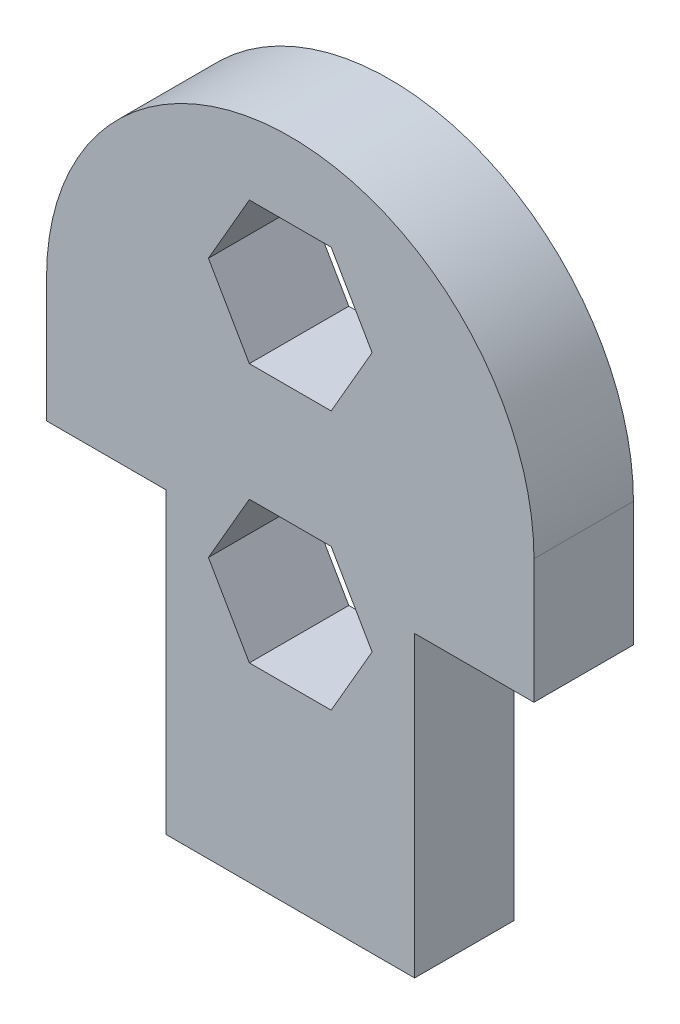
ISO-10303-21;
HEADER;
FILE_DESCRIPTION(('STEP AP214'),'2;1');
FILE_NAME('part.step','',(''),(''),'','','');
FILE_SCHEMA(('AUTOMOTIVE_DESIGN { 1 0 10303 214 1 1 1 1 }'));
ENDSEC;
DATA;
#1=APPLICATION_CONTEXT('core data for automotive mechanical design processes');
#2=APPLICATION_PROTOCOL_DEFINITION('international standard','automotive_design',2000,#1);
#3=PRODUCT_CONTEXT('',#1,'mechanical');
#4=PRODUCT('Part','Part','',(#3));
#5=PRODUCT_RELATED_PRODUCT_CATEGORY('part','',(#4));
#6=PRODUCT_DEFINITION_FORMATION('','',#4);
#7=PRODUCT_DEFINITION_CONTEXT('part definition',#1,'design');
#8=PRODUCT_DEFINITION('design','',#6,#7);
#9=PRODUCT_DEFINITION_SHAPE('','',#8);
#10=(LENGTH_UNIT() NAMED_UNIT(*) SI_UNIT(.MILLI.,.METRE.));
#11=(NAMED_UNIT(*) PLANE_ANGLE_UNIT() SI_UNIT($,.RADIAN.));
#12=(NAMED_UNIT(*) SI_UNIT($,.STERADIAN.) SOLID_ANGLE_UNIT());
#13=UNCERTAINTY_MEASURE_WITH_UNIT(LENGTH_MEASURE(1.E-05),#10,'distance_accuracy_value','');
#14=(GEOMETRIC_REPRESENTATION_CONTEXT(3) GLOBAL_UNCERTAINTY_ASSIGNED_CONTEXT((#13)) GLOBAL_UNIT_ASSIGNED_CONTEXT((#10,
#11,#12)) REPRESENTATION_CONTEXT('',''));
#15=CARTESIAN_POINT('',(0.,0.,0.));
#16=DIRECTION('',(0.,0.,1.));
#17=DIRECTION('',(1.,0.,0.));
#18=AXIS2_PLACEMENT_3D('',#15,#16,#17);
#19=CARTESIAN_POINT('',(5.,17.,4.));
#20=DIRECTION('',(0.,0.,1.));
#21=DIRECTION('',(1.,0.,0.));
#22=AXIS2_PLACEMENT_3D('',#19,#20,#21);
#23=PLANE('',#22);
#24=DIRECTION('',(0.,1.,0.));
#25=VECTOR('',#24,1.);
#26=CARTESIAN_POINT('',(10.,0.,4.));
#27=LINE('',#26,#25);
#28=CARTESIAN_POINT('',(10.,0.,4.));
#29=VERTEX_POINT('',#28);
#30=CARTESIAN_POINT('',(10.,12.,4.));
#31=VERTEX_POINT('',#30);
#32=EDGE_CURVE('E272',#29,#31,#27,.T.);
#33=ORIENTED_EDGE('',*,*,#32,.T.);
#34=DIRECTION('',(1.,0.,0.));
#35=VECTOR('',#34,1.);
#36=CARTESIAN_POINT('',(10.,12.,4.));
#37=LINE('',#36,#35);
#38=CARTESIAN_POINT('',(14.8,12.,4.));
#39=VERTEX_POINT('',#38);
#40=EDGE_CURVE('E274',#31,#39,#37,.T.);
#41=ORIENTED_EDGE('',*,*,#40,.T.);
#42=DIRECTION('',(0.,1.,0.));
#43=VECTOR('',#42,1.);
#44=CARTESIAN_POINT('',(14.8,12.,4.));
#45=LINE('',#44,#43);
#46=CARTESIAN_POINT('',(14.8,17.,4.));
#47=VERTEX_POINT('',#46);
#48=EDGE_CURVE('E276',#39,#47,#45,.T.);
#49=ORIENTED_EDGE('',*,*,#48,.T.);
#50=CARTESIAN_POINT('',(5.,17.,4.));
#51=DIRECTION('',(0.,0.,1.));
#52=DIRECTION('',(1.,0.,0.));
#53=AXIS2_PLACEMENT_3D('',#50,#51,#52);
#54=CIRCLE('',#53,9.8);
#55=CARTESIAN_POINT('',(-4.8,17.,4.));
#56=VERTEX_POINT('',#55);
#57=EDGE_CURVE('E278',#47,#56,#54,.T.);
#58=ORIENTED_EDGE('',*,*,#57,.T.);
#59=DIRECTION('',(0.,-1.,0.));
#60=VECTOR('',#59,1.);
#61=CARTESIAN_POINT('',(-4.8,12.,4.));
#62=LINE('',#61,#60);
#63=CARTESIAN_POINT('',(-4.8,12.,4.));
#64=VERTEX_POINT('',#63);
#65=EDGE_CURVE('E280',#56,#64,#62,.T.);
#66=ORIENTED_EDGE('',*,*,#65,.T.);
#67=DIRECTION('',(1.,0.,0.));
#68=VECTOR('',#67,1.);
#69=CARTESIAN_POINT('',(0.,12.,4.));
#70=LINE('',#69,#68);
#71=CARTESIAN_POINT('',(0.,12.,4.));
#72=VERTEX_POINT('',#71);
#73=EDGE_CURVE('E282',#64,#72,#70,.T.);
#74=ORIENTED_EDGE('',*,*,#73,.T.);
#75=DIRECTION('',(0.,-1.,0.));
#76=VECTOR('',#75,1.);
#77=CARTESIAN_POINT('',(0.,0.,4.));
#78=LINE('',#77,#76);
#79=CARTESIAN_POINT('',(0.,0.,4.));
#80=VERTEX_POINT('',#79);
#81=EDGE_CURVE('E266',#72,#80,#78,.T.);
#82=ORIENTED_EDGE('',*,*,#81,.T.);
#83=DIRECTION('',(1.,0.,0.));
#84=VECTOR('',#83,1.);
#85=CARTESIAN_POINT('',(0.,0.,4.));
#86=LINE('',#85,#84);
#87=EDGE_CURVE('E269',#80,#29,#86,.T.);
#88=ORIENTED_EDGE('',*,*,#87,.T.);
#89=EDGE_LOOP('',(#33,#41,#49,#58,#66,#74,#82,#88));
#90=FACE_BOUND('',#89,.T.);
#91=DIRECTION('',(-0.5,-0.866025403784439,0.));
#92=VECTOR('',#91,1.);
#93=CARTESIAN_POINT('',(3.35455173280957,23.7711723588727,4.));
#94=LINE('',#93,#92);
#95=CARTESIAN_POINT('',(3.35455173280957,23.7711723588727,4.));
#96=VERTEX_POINT('',#95);
#97=CARTESIAN_POINT('',(1.70910346561913,20.9211723588727,4.));
#98=VERTEX_POINT('',#97);
#99=EDGE_CURVE('E223',#96,#98,#94,.T.);
#100=ORIENTED_EDGE('',*,*,#99,.F.);
#101=DIRECTION('',(-1.,0.,0.));
#102=VECTOR('',#101,1.);
#103=CARTESIAN_POINT('',(6.64544826719043,23.7711723588727,4.));
#104=LINE('',#103,#102);
#105=CARTESIAN_POINT('',(6.64544826719043,23.7711723588727,4.));
#106=VERTEX_POINT('',#105);
#107=EDGE_CURVE('E221',#106,#96,#104,.T.);
#108=ORIENTED_EDGE('',*,*,#107,.F.);
#109=DIRECTION('',(-0.5,0.866025403784438,0.));
#110=VECTOR('',#109,1.);
#111=CARTESIAN_POINT('',(8.29089653438087,20.9211723588727,4.));
#112=LINE('',#111,#110);
#113=CARTESIAN_POINT('',(8.29089653438087,20.9211723588727,4.));
#114=VERTEX_POINT('',#113);
#115=EDGE_CURVE('E233',#114,#106,#112,.T.);
#116=ORIENTED_EDGE('',*,*,#115,.F.);
#117=DIRECTION('',(0.499999999999999,0.866025403784439,0.));
#118=VECTOR('',#117,1.);
#119=CARTESIAN_POINT('',(6.64544826719044,18.0711723588727,4.));
#120=LINE('',#119,#118);
#121=CARTESIAN_POINT('',(6.64544826719044,18.0711723588727,4.));
#122=VERTEX_POINT('',#121);
#123=EDGE_CURVE('E230',#122,#114,#120,.T.);
#124=ORIENTED_EDGE('',*,*,#123,.F.);
#125=DIRECTION('',(1.,0.,0.));
#126=VECTOR('',#125,1.);
#127=CARTESIAN_POINT('',(3.35455173280957,18.0711723588727,4.));
#128=LINE('',#127,#126);
#129=CARTESIAN_POINT('',(3.35455173280957,18.0711723588727,4.));
#130=VERTEX_POINT('',#129);
#131=EDGE_CURVE('E228',#130,#122,#128,.T.);
#132=ORIENTED_EDGE('',*,*,#131,.F.);
#133=DIRECTION('',(0.499999999999999,-0.866025403784439,0.));
#134=VECTOR('',#133,1.);
#135=CARTESIAN_POINT('',(1.70910346561913,20.9211723588727,4.));
#136=LINE('',#135,#134);
#137=EDGE_CURVE('E226',#98,#130,#136,.T.);
#138=ORIENTED_EDGE('',*,*,#137,.F.);
#139=EDGE_LOOP('',(#100,#108,#116,#124,#132,#138));
#140=FACE_BOUND('',#139,.T.);
#141=DIRECTION('',(-0.5,-0.866025403784439,0.));
#142=VECTOR('',#141,1.);
#143=CARTESIAN_POINT('',(3.35455173280957,13.35,4.));
#144=LINE('',#143,#142);
#145=CARTESIAN_POINT('',(3.35455173280957,13.35,4.));
#146=VERTEX_POINT('',#145);
#147=CARTESIAN_POINT('',(1.70910346561913,10.5,4.));
#148=VERTEX_POINT('',#147);
#149=EDGE_CURVE('E178',#146,#148,#144,.T.);
#150=ORIENTED_EDGE('',*,*,#149,.F.);
#151=DIRECTION('',(-1.,0.,0.));
#152=VECTOR('',#151,1.);
#153=CARTESIAN_POINT('',(6.64544826719043,13.35,4.));
#154=LINE('',#153,#152);
#155=CARTESIAN_POINT('',(6.64544826719043,13.35,4.));
#156=VERTEX_POINT('',#155);
#157=EDGE_CURVE('E170',#156,#146,#154,.T.);
#158=ORIENTED_EDGE('',*,*,#157,.F.);
#159=DIRECTION('',(-0.5,0.866025403784439,0.));
#160=VECTOR('',#159,1.);
#161=CARTESIAN_POINT('',(8.29089653438087,10.5,4.));
#162=LINE('',#161,#160);
#163=CARTESIAN_POINT('',(8.29089653438087,10.5,4.));
#164=VERTEX_POINT('',#163);
#165=EDGE_CURVE('E199',#164,#156,#162,.T.);
#166=ORIENTED_EDGE('',*,*,#165,.F.);
#167=DIRECTION('',(0.5,0.866025403784439,0.));
#168=VECTOR('',#167,1.);
#169=CARTESIAN_POINT('',(6.64544826719043,7.65,4.));
#170=LINE('',#169,#168);
#171=CARTESIAN_POINT('',(6.64544826719043,7.65,4.));
#172=VERTEX_POINT('',#171);
#173=EDGE_CURVE('E197',#172,#164,#170,.T.);
#174=ORIENTED_EDGE('',*,*,#173,.F.);
#175=DIRECTION('',(1.,0.,0.));
#176=VECTOR('',#175,1.);
#177=CARTESIAN_POINT('',(3.35455173280956,7.65,4.));
#178=LINE('',#177,#176);
#179=CARTESIAN_POINT('',(3.35455173280956,7.65,4.));
#180=VERTEX_POINT('',#179);
#181=EDGE_CURVE('E193',#180,#172,#178,.T.);
#182=ORIENTED_EDGE('',*,*,#181,.F.);
#183=DIRECTION('',(0.499999999999999,-0.866025403784439,0.));
#184=VECTOR('',#183,1.);
#185=CARTESIAN_POINT('',(1.70910346561913,10.5,4.));
#186=LINE('',#185,#184);
#187=EDGE_CURVE('E191',#148,#180,#186,.T.);
#188=ORIENTED_EDGE('',*,*,#187,.F.);
#189=EDGE_LOOP('',(#150,#158,#166,#174,#182,#188));
#190=FACE_BOUND('',#189,.T.);
#191=ADVANCED_FACE('F33',(#90,#140,#190),#23,.T.);
#192=CARTESIAN_POINT('',(5.,17.,0.));
#193=DIRECTION('',(0.,0.,1.));
#194=DIRECTION('',(1.,0.,0.));
#195=AXIS2_PLACEMENT_3D('',#192,#193,#194);
#196=PLANE('',#195);
#197=DIRECTION('',(-1.,0.,0.));
#198=VECTOR('',#197,1.);
#199=CARTESIAN_POINT('',(6.64544826719043,23.7711723588727,0.));
#200=LINE('',#199,#198);
#201=CARTESIAN_POINT('',(6.64544826719043,23.7711723588727,0.));
#202=VERTEX_POINT('',#201);
#203=CARTESIAN_POINT('',(3.35455173280957,23.7711723588727,0.));
#204=VERTEX_POINT('',#203);
#205=EDGE_CURVE('E186',#202,#204,#200,.T.);
#206=ORIENTED_EDGE('',*,*,#205,.T.);
#207=DIRECTION('',(-0.5,-0.866025403784439,0.));
#208=VECTOR('',#207,1.);
#209=CARTESIAN_POINT('',(3.35455173280957,23.7711723588727,0.));
#210=LINE('',#209,#208);
#211=CARTESIAN_POINT('',(1.70910346561913,20.9211723588727,0.));
#212=VERTEX_POINT('',#211);
#213=EDGE_CURVE('E238',#204,#212,#210,.T.);
#214=ORIENTED_EDGE('',*,*,#213,.T.);
#215=DIRECTION('',(0.499999999999999,-0.866025403784439,0.));
#216=VECTOR('',#215,1.);
#217=CARTESIAN_POINT('',(1.70910346561913,20.9211723588727,0.));
#218=LINE('',#217,#216);
#219=CARTESIAN_POINT('',(3.35455173280957,18.0711723588727,0.));
#220=VERTEX_POINT('',#219);
#221=EDGE_CURVE('E241',#212,#220,#218,.T.);
#222=ORIENTED_EDGE('',*,*,#221,.T.);
#223=DIRECTION('',(1.,0.,0.));
#224=VECTOR('',#223,1.);
#225=CARTESIAN_POINT('',(3.35455173280957,18.0711723588727,0.));
#226=LINE('',#225,#224);
#227=CARTESIAN_POINT('',(6.64544826719044,18.0711723588727,0.));
#228=VERTEX_POINT('',#227);
#229=EDGE_CURVE('E244',#220,#228,#226,.T.);
#230=ORIENTED_EDGE('',*,*,#229,.T.);
#231=DIRECTION('',(0.499999999999999,0.866025403784439,0.));
#232=VECTOR('',#231,1.);
#233=CARTESIAN_POINT('',(6.64544826719044,18.0711723588727,0.));
#234=LINE('',#233,#232);
#235=CARTESIAN_POINT('',(8.29089653438087,20.9211723588727,0.));
#236=VERTEX_POINT('',#235);
#237=EDGE_CURVE('E247',#228,#236,#234,.T.);
#238=ORIENTED_EDGE('',*,*,#237,.T.);
#239=DIRECTION('',(-0.5,0.866025403784438,0.));
#240=VECTOR('',#239,1.);
#241=CARTESIAN_POINT('',(8.29089653438087,20.9211723588727,0.));
#242=LINE('',#241,#240);
#243=EDGE_CURVE('E224',#236,#202,#242,.T.);
#244=ORIENTED_EDGE('',*,*,#243,.T.);
#245=EDGE_LOOP('',(#206,#214,#222,#230,#238,#244));
#246=FACE_BOUND('',#245,.T.);
#247=DIRECTION('',(0.,1.,0.));
#248=VECTOR('',#247,1.);
#249=CARTESIAN_POINT('',(10.,8.,0.));
#250=LINE('',#249,#248);
#251=CARTESIAN_POINT('',(10.,0.,0.));
#252=VERTEX_POINT('',#251);
#253=CARTESIAN_POINT('',(10.,12.,0.));
#254=VERTEX_POINT('',#253);
#255=EDGE_CURVE('E288',#252,#254,#250,.T.);
#256=ORIENTED_EDGE('',*,*,#255,.F.);
#257=DIRECTION('',(1.,0.,0.));
#258=VECTOR('',#257,1.);
#259=CARTESIAN_POINT('',(0.,0.,0.));
#260=LINE('',#259,#258);
#261=CARTESIAN_POINT('',(0.,0.,0.));
#262=VERTEX_POINT('',#261);
#263=EDGE_CURVE('E265',#262,#252,#260,.T.);
#264=ORIENTED_EDGE('',*,*,#263,.F.);
#265=DIRECTION('',(0.,-1.,0.));
#266=VECTOR('',#265,1.);
#267=CARTESIAN_POINT('',(0.,8.,0.));
#268=LINE('',#267,#266);
#269=CARTESIAN_POINT('',(0.,12.,0.));
#270=VERTEX_POINT('',#269);
#271=EDGE_CURVE('E270',#270,#262,#268,.T.);
#272=ORIENTED_EDGE('',*,*,#271,.F.);
#273=DIRECTION('',(1.,0.,0.));
#274=VECTOR('',#273,1.);
#275=CARTESIAN_POINT('',(0.,12.,0.));
#276=LINE('',#275,#274);
#277=CARTESIAN_POINT('',(-4.8,12.,0.));
#278=VERTEX_POINT('',#277);
#279=EDGE_CURVE('E298',#278,#270,#276,.T.);
#280=ORIENTED_EDGE('',*,*,#279,.F.);
#281=DIRECTION('',(0.,-1.,0.));
#282=VECTOR('',#281,1.);
#283=CARTESIAN_POINT('',(-4.8,12.,0.));
#284=LINE('',#283,#282);
#285=CARTESIAN_POINT('',(-4.8,17.,0.));
#286=VERTEX_POINT('',#285);
#287=EDGE_CURVE('E296',#286,#278,#284,.T.);
#288=ORIENTED_EDGE('',*,*,#287,.F.);
#289=CARTESIAN_POINT('',(5.,17.,0.));
#290=DIRECTION('',(0.,0.,1.));
#291=DIRECTION('',(1.,0.,0.));
#292=AXIS2_PLACEMENT_3D('',#289,#290,#291);
#293=CIRCLE('',#292,9.8);
#294=CARTESIAN_POINT('',(14.8,17.,0.));
#295=VERTEX_POINT('',#294);
#296=EDGE_CURVE('E294',#295,#286,#293,.T.);
#297=ORIENTED_EDGE('',*,*,#296,.F.);
#298=DIRECTION('',(0.,1.,0.));
#299=VECTOR('',#298,1.);
#300=CARTESIAN_POINT('',(14.8,12.,0.));
#301=LINE('',#300,#299);
#302=CARTESIAN_POINT('',(14.8,12.,0.));
#303=VERTEX_POINT('',#302);
#304=EDGE_CURVE('E292',#303,#295,#301,.T.);
#305=ORIENTED_EDGE('',*,*,#304,.F.);
#306=DIRECTION('',(1.,0.,0.));
#307=VECTOR('',#306,1.);
#308=CARTESIAN_POINT('',(10.,12.,0.));
#309=LINE('',#308,#307);
#310=EDGE_CURVE('E290',#254,#303,#309,.T.);
#311=ORIENTED_EDGE('',*,*,#310,.F.);
#312=EDGE_LOOP('',(#256,#264,#272,#280,#288,#297,#305,#311));
#313=FACE_BOUND('',#312,.T.);
#314=DIRECTION('',(-1.,0.,0.));
#315=VECTOR('',#314,1.);
#316=CARTESIAN_POINT('',(6.64544826719043,13.35,0.));
#317=LINE('',#316,#315);
#318=CARTESIAN_POINT('',(6.64544826719043,13.35,0.));
#319=VERTEX_POINT('',#318);
#320=CARTESIAN_POINT('',(3.35455173280957,13.35,0.));
#321=VERTEX_POINT('',#320);
#322=EDGE_CURVE('E56',#319,#321,#317,.T.);
#323=ORIENTED_EDGE('',*,*,#322,.T.);
#324=DIRECTION('',(-0.5,-0.866025403784439,0.));
#325=VECTOR('',#324,1.);
#326=CARTESIAN_POINT('',(3.35455173280957,13.35,0.));
#327=LINE('',#326,#325);
#328=CARTESIAN_POINT('',(1.70910346561913,10.5,0.));
#329=VERTEX_POINT('',#328);
#330=EDGE_CURVE('E185',#321,#329,#327,.T.);
#331=ORIENTED_EDGE('',*,*,#330,.T.);
#332=DIRECTION('',(0.499999999999999,-0.866025403784439,0.));
#333=VECTOR('',#332,1.);
#334=CARTESIAN_POINT('',(1.70910346561913,10.5,0.));
#335=LINE('',#334,#333);
#336=CARTESIAN_POINT('',(3.35455173280956,7.65,0.));
#337=VERTEX_POINT('',#336);
#338=EDGE_CURVE('E203',#329,#337,#335,.T.);
#339=ORIENTED_EDGE('',*,*,#338,.T.);
#340=DIRECTION('',(1.,0.,0.));
#341=VECTOR('',#340,1.);
#342=CARTESIAN_POINT('',(3.35455173280956,7.65,0.));
#343=LINE('',#342,#341);
#344=CARTESIAN_POINT('',(6.64544826719043,7.65,0.));
#345=VERTEX_POINT('',#344);
#346=EDGE_CURVE('E206',#337,#345,#343,.T.);
#347=ORIENTED_EDGE('',*,*,#346,.T.);
#348=DIRECTION('',(0.5,0.866025403784439,0.));
#349=VECTOR('',#348,1.);
#350=CARTESIAN_POINT('',(6.64544826719043,7.65,0.));
#351=LINE('',#350,#349);
#352=CARTESIAN_POINT('',(8.29089653438087,10.5,0.));
#353=VERTEX_POINT('',#352);
#354=EDGE_CURVE('E209',#345,#353,#351,.T.);
#355=ORIENTED_EDGE('',*,*,#354,.T.);
#356=DIRECTION('',(-0.5,0.866025403784439,0.));
#357=VECTOR('',#356,1.);
#358=CARTESIAN_POINT('',(8.29089653438087,10.5,0.));
#359=LINE('',#358,#357);
#360=EDGE_CURVE('E179',#353,#319,#359,.T.);
#361=ORIENTED_EDGE('',*,*,#360,.T.);
#362=EDGE_LOOP('',(#323,#331,#339,#347,#355,#361));
#363=FACE_BOUND('',#362,.T.);
#364=ADVANCED_FACE('F328',(#246,#313,#363),#196,.F.);
#365=CARTESIAN_POINT('',(0.,0.,4.));
#366=DIRECTION('',(0.,1.,0.));
#367=DIRECTION('',(0.,0.,1.));
#368=AXIS2_PLACEMENT_3D('',#365,#366,#367);
#369=PLANE('',#368);
#370=ORIENTED_EDGE('',*,*,#263,.T.);
#371=DIRECTION('',(0.,0.,-1.));
#372=VECTOR('',#371,1.);
#373=CARTESIAN_POINT('',(10.,0.,4.));
#374=LINE('',#373,#372);
#375=EDGE_CURVE('E41',#29,#252,#374,.T.);
#376=ORIENTED_EDGE('',*,*,#375,.F.);
#377=ORIENTED_EDGE('',*,*,#87,.F.);
#378=DIRECTION('',(0.,0.,-1.));
#379=VECTOR('',#378,1.);
#380=CARTESIAN_POINT('',(0.,0.,4.));
#381=LINE('',#380,#379);
#382=EDGE_CURVE('E11',#80,#262,#381,.T.);
#383=ORIENTED_EDGE('',*,*,#382,.T.);
#384=EDGE_LOOP('',(#370,#376,#377,#383));
#385=FACE_BOUND('',#384,.T.);
#386=ADVANCED_FACE('F35',(#385),#369,.F.);
#387=CARTESIAN_POINT('',(10.,8.,4.));
#388=DIRECTION('',(-1.,0.,0.));
#389=DIRECTION('',(0.,0.,1.));
#390=AXIS2_PLACEMENT_3D('',#387,#388,#389);
#391=PLANE('',#390);
#392=ORIENTED_EDGE('',*,*,#255,.T.);
#393=DIRECTION('',(0.,0.,-1.));
#394=VECTOR('',#393,1.);
#395=CARTESIAN_POINT('',(10.,12.,4.));
#396=LINE('',#395,#394);
#397=EDGE_CURVE('E315',#31,#254,#396,.T.);
#398=ORIENTED_EDGE('',*,*,#397,.F.);
#399=ORIENTED_EDGE('',*,*,#32,.F.);
#400=ORIENTED_EDGE('',*,*,#375,.T.);
#401=EDGE_LOOP('',(#392,#398,#399,#400));
#402=FACE_BOUND('',#401,.T.);
#403=ADVANCED_FACE('F321',(#402),#391,.F.);
#404=CARTESIAN_POINT('',(10.,12.,4.));
#405=DIRECTION('',(0.,1.,0.));
#406=DIRECTION('',(0.,0.,1.));
#407=AXIS2_PLACEMENT_3D('',#404,#405,#406);
#408=PLANE('',#407);
#409=ORIENTED_EDGE('',*,*,#310,.T.);
#410=DIRECTION('',(0.,0.,-1.));
#411=VECTOR('',#410,1.);
#412=CARTESIAN_POINT('',(14.8,12.,4.));
#413=LINE('',#412,#411);
#414=EDGE_CURVE('E312',#39,#303,#413,.T.);
#415=ORIENTED_EDGE('',*,*,#414,.F.);
#416=ORIENTED_EDGE('',*,*,#40,.F.);
#417=ORIENTED_EDGE('',*,*,#397,.T.);
#418=EDGE_LOOP('',(#409,#415,#416,#417));
#419=FACE_BOUND('',#418,.T.);
#420=ADVANCED_FACE('F336',(#419),#408,.F.);
#421=CARTESIAN_POINT('',(14.8,12.,4.));
#422=DIRECTION('',(-1.,0.,0.));
#423=DIRECTION('',(0.,0.,1.));
#424=AXIS2_PLACEMENT_3D('',#421,#422,#423);
#425=PLANE('',#424);
#426=ORIENTED_EDGE('',*,*,#304,.T.);
#427=DIRECTION('',(0.,0.,-1.));
#428=VECTOR('',#427,1.);
#429=CARTESIAN_POINT('',(14.8,17.,4.));
#430=LINE('',#429,#428);
#431=EDGE_CURVE('E309',#47,#295,#430,.T.);
#432=ORIENTED_EDGE('',*,*,#431,.F.);
#433=ORIENTED_EDGE('',*,*,#48,.F.);
#434=ORIENTED_EDGE('',*,*,#414,.T.);
#435=EDGE_LOOP('',(#426,#432,#433,#434));
#436=FACE_BOUND('',#435,.T.);
#437=ADVANCED_FACE('F340',(#436),#425,.F.);
#438=CARTESIAN_POINT('',(5.,17.,4.));
#439=DIRECTION('',(0.,0.,-1.));
#440=DIRECTION('',(-1.,0.,0.));
#441=AXIS2_PLACEMENT_3D('',#438,#439,#440);
#442=CYLINDRICAL_SURFACE('',#441,9.8);
#443=ORIENTED_EDGE('',*,*,#296,.T.);
#444=DIRECTION('',(0.,0.,-1.));
#445=VECTOR('',#444,1.);
#446=CARTESIAN_POINT('',(-4.8,17.,4.));
#447=LINE('',#446,#445);
#448=EDGE_CURVE('E306',#56,#286,#447,.T.);
#449=ORIENTED_EDGE('',*,*,#448,.F.);
#450=ORIENTED_EDGE('',*,*,#57,.F.);
#451=ORIENTED_EDGE('',*,*,#431,.T.);
#452=EDGE_LOOP('',(#443,#449,#450,#451));
#453=FACE_BOUND('',#452,.T.);
#454=ADVANCED_FACE('F358',(#453),#442,.T.);
#455=CARTESIAN_POINT('',(-4.8,12.,4.));
#456=DIRECTION('',(1.,0.,0.));
#457=DIRECTION('',(0.,0.,-1.));
#458=AXIS2_PLACEMENT_3D('',#455,#456,#457);
#459=PLANE('',#458);
#460=ORIENTED_EDGE('',*,*,#287,.T.);
#461=DIRECTION('',(0.,0.,-1.));
#462=VECTOR('',#461,1.);
#463=CARTESIAN_POINT('',(-4.8,12.,4.));
#464=LINE('',#463,#462);
#465=EDGE_CURVE('E303',#64,#278,#464,.T.);
#466=ORIENTED_EDGE('',*,*,#465,.F.);
#467=ORIENTED_EDGE('',*,*,#65,.F.);
#468=ORIENTED_EDGE('',*,*,#448,.T.);
#469=EDGE_LOOP('',(#460,#466,#467,#468));
#470=FACE_BOUND('',#469,.T.);
#471=ADVANCED_FACE('F355',(#470),#459,.F.);
#472=CARTESIAN_POINT('',(0.,12.,4.));
#473=DIRECTION('',(0.,1.,0.));
#474=DIRECTION('',(0.,0.,1.));
#475=AXIS2_PLACEMENT_3D('',#472,#473,#474);
#476=PLANE('',#475);
#477=ORIENTED_EDGE('',*,*,#279,.T.);
#478=DIRECTION('',(0.,0.,-1.));
#479=VECTOR('',#478,1.);
#480=CARTESIAN_POINT('',(0.,12.,4.));
#481=LINE('',#480,#479);
#482=EDGE_CURVE('E285',#72,#270,#481,.T.);
#483=ORIENTED_EDGE('',*,*,#482,.F.);
#484=ORIENTED_EDGE('',*,*,#73,.F.);
#485=ORIENTED_EDGE('',*,*,#465,.T.);
#486=EDGE_LOOP('',(#477,#483,#484,#485));
#487=FACE_BOUND('',#486,.T.);
#488=ADVANCED_FACE('F351',(#487),#476,.F.);
#489=CARTESIAN_POINT('',(0.,8.,4.));
#490=DIRECTION('',(1.,0.,0.));
#491=DIRECTION('',(0.,0.,-1.));
#492=AXIS2_PLACEMENT_3D('',#489,#490,#491);
#493=PLANE('',#492);
#494=ORIENTED_EDGE('',*,*,#271,.T.);
#495=ORIENTED_EDGE('',*,*,#382,.F.);
#496=ORIENTED_EDGE('',*,*,#81,.F.);
#497=ORIENTED_EDGE('',*,*,#482,.T.);
#498=EDGE_LOOP('',(#494,#495,#496,#497));
#499=FACE_BOUND('',#498,.T.);
#500=ADVANCED_FACE('F349',(#499),#493,.F.);
#501=CARTESIAN_POINT('',(6.64544826719043,23.7711723588727,4.));
#502=DIRECTION('',(0.,-1.,0.));
#503=DIRECTION('',(0.,0.,-1.));
#504=AXIS2_PLACEMENT_3D('',#501,#502,#503);
#505=PLANE('',#504);
#506=ORIENTED_EDGE('',*,*,#205,.F.);
#507=DIRECTION('',(0.,0.,-1.));
#508=VECTOR('',#507,1.);
#509=CARTESIAN_POINT('',(6.64544826719043,23.7711723588727,4.));
#510=LINE('',#509,#508);
#511=EDGE_CURVE('E235',#106,#202,#510,.T.);
#512=ORIENTED_EDGE('',*,*,#511,.F.);
#513=ORIENTED_EDGE('',*,*,#107,.T.);
#514=DIRECTION('',(0.,0.,-1.));
#515=VECTOR('',#514,1.);
#516=CARTESIAN_POINT('',(3.35455173280957,23.7711723588727,4.));
#517=LINE('',#516,#515);
#518=EDGE_CURVE('E262',#96,#204,#517,.T.);
#519=ORIENTED_EDGE('',*,*,#518,.T.);
#520=EDGE_LOOP('',(#506,#512,#513,#519));
#521=FACE_BOUND('',#520,.T.);
#522=ADVANCED_FACE('F375',(#521),#505,.T.);
#523=CARTESIAN_POINT('',(3.35455173280957,23.7711723588727,4.));
#524=DIRECTION('',(0.866025403784439,-0.5,0.));
#525=DIRECTION('',(0.5,0.866025403784439,0.));
#526=AXIS2_PLACEMENT_3D('',#523,#524,#525);
#527=PLANE('',#526);
#528=ORIENTED_EDGE('',*,*,#213,.F.);
#529=ORIENTED_EDGE('',*,*,#518,.F.);
#530=ORIENTED_EDGE('',*,*,#99,.T.);
#531=DIRECTION('',(0.,0.,-1.));
#532=VECTOR('',#531,1.);
#533=CARTESIAN_POINT('',(1.70910346561913,20.9211723588727,4.));
#534=LINE('',#533,#532);
#535=EDGE_CURVE('E260',#98,#212,#534,.T.);
#536=ORIENTED_EDGE('',*,*,#535,.T.);
#537=EDGE_LOOP('',(#528,#529,#530,#536));
#538=FACE_BOUND('',#537,.T.);
#539=ADVANCED_FACE('F396',(#538),#527,.T.);
#540=CARTESIAN_POINT('',(1.70910346561913,20.9211723588727,4.));
#541=DIRECTION('',(0.866025403784439,0.5,0.));
#542=DIRECTION('',(-0.499999999999999,0.866025403784439,0.));
#543=AXIS2_PLACEMENT_3D('',#540,#541,#542);
#544=PLANE('',#543);
#545=ORIENTED_EDGE('',*,*,#221,.F.);
#546=ORIENTED_EDGE('',*,*,#535,.F.);
#547=ORIENTED_EDGE('',*,*,#137,.T.);
#548=DIRECTION('',(0.,0.,-1.));
#549=VECTOR('',#548,1.);
#550=CARTESIAN_POINT('',(3.35455173280957,18.0711723588727,4.));
#551=LINE('',#550,#549);
#552=EDGE_CURVE('E258',#130,#220,#551,.T.);
#553=ORIENTED_EDGE('',*,*,#552,.T.);
#554=EDGE_LOOP('',(#545,#546,#547,#553));
#555=FACE_BOUND('',#554,.T.);
#556=ADVANCED_FACE('F403',(#555),#544,.T.);
#557=CARTESIAN_POINT('',(3.35455173280957,18.0711723588727,4.));
#558=DIRECTION('',(0.,1.,0.));
#559=DIRECTION('',(-1.,0.,0.));
#560=AXIS2_PLACEMENT_3D('',#557,#558,#559);
#561=PLANE('',#560);
#562=ORIENTED_EDGE('',*,*,#229,.F.);
#563=ORIENTED_EDGE('',*,*,#552,.F.);
#564=ORIENTED_EDGE('',*,*,#131,.T.);
#565=DIRECTION('',(0.,0.,-1.));
#566=VECTOR('',#565,1.);
#567=CARTESIAN_POINT('',(6.64544826719044,18.0711723588727,4.));
#568=LINE('',#567,#566);
#569=EDGE_CURVE('E256',#122,#228,#568,.T.);
#570=ORIENTED_EDGE('',*,*,#569,.T.);
#571=EDGE_LOOP('',(#562,#563,#564,#570));
#572=FACE_BOUND('',#571,.T.);
#573=ADVANCED_FACE('F410',(#572),#561,.T.);
#574=CARTESIAN_POINT('',(6.64544826719044,18.0711723588727,4.));
#575=DIRECTION('',(-0.866025403784439,0.499999999999999,0.));
#576=DIRECTION('',(-0.499999999999999,-0.866025403784439,0.));
#577=AXIS2_PLACEMENT_3D('',#574,#575,#576);
#578=PLANE('',#577);
#579=ORIENTED_EDGE('',*,*,#237,.F.);
#580=ORIENTED_EDGE('',*,*,#569,.F.);
#581=ORIENTED_EDGE('',*,*,#123,.T.);
#582=DIRECTION('',(0.,0.,-1.));
#583=VECTOR('',#582,1.);
#584=CARTESIAN_POINT('',(8.29089653438087,20.9211723588727,4.));
#585=LINE('',#584,#583);
#586=EDGE_CURVE('E254',#114,#236,#585,.T.);
#587=ORIENTED_EDGE('',*,*,#586,.T.);
#588=EDGE_LOOP('',(#579,#580,#581,#587));
#589=FACE_BOUND('',#588,.T.);
#590=ADVANCED_FACE('F418',(#589),#578,.T.);
#591=CARTESIAN_POINT('',(8.29089653438087,20.9211723588727,4.));
#592=DIRECTION('',(-0.866025403784438,-0.5,0.));
#593=DIRECTION('',(0.5,-0.866025403784438,0.));
#594=AXIS2_PLACEMENT_3D('',#591,#592,#593);
#595=PLANE('',#594);
#596=ORIENTED_EDGE('',*,*,#243,.F.);
#597=ORIENTED_EDGE('',*,*,#586,.F.);
#598=ORIENTED_EDGE('',*,*,#115,.T.);
#599=ORIENTED_EDGE('',*,*,#511,.T.);
#600=EDGE_LOOP('',(#596,#597,#598,#599));
#601=FACE_BOUND('',#600,.T.);
#602=ADVANCED_FACE('F426',(#601),#595,.T.);
#603=CARTESIAN_POINT('',(6.64544826719043,13.35,4.));
#604=DIRECTION('',(0.,-1.,0.));
#605=DIRECTION('',(0.,0.,-1.));
#606=AXIS2_PLACEMENT_3D('',#603,#604,#605);
#607=PLANE('',#606);
#608=ORIENTED_EDGE('',*,*,#322,.F.);
#609=DIRECTION('',(0.,0.,-1.));
#610=VECTOR('',#609,1.);
#611=CARTESIAN_POINT('',(6.64544826719043,13.35,4.));
#612=LINE('',#611,#610);
#613=EDGE_CURVE('E174',#156,#319,#612,.T.);
#614=ORIENTED_EDGE('',*,*,#613,.F.);
#615=ORIENTED_EDGE('',*,*,#157,.T.);
#616=DIRECTION('',(0.,0.,-1.));
#617=VECTOR('',#616,1.);
#618=CARTESIAN_POINT('',(3.35455173280957,13.35,4.));
#619=LINE('',#618,#617);
#620=EDGE_CURVE('E173',#146,#321,#619,.T.);
#621=ORIENTED_EDGE('',*,*,#620,.T.);
#622=EDGE_LOOP('',(#608,#614,#615,#621));
#623=FACE_BOUND('',#622,.T.);
#624=ADVANCED_FACE('F172',(#623),#607,.T.);
#625=CARTESIAN_POINT('',(3.35455173280957,13.35,4.));
#626=DIRECTION('',(0.866025403784439,-0.5,0.));
#627=DIRECTION('',(0.5,0.866025403784439,0.));
#628=AXIS2_PLACEMENT_3D('',#625,#626,#627);
#629=PLANE('',#628);
#630=ORIENTED_EDGE('',*,*,#330,.F.);
#631=ORIENTED_EDGE('',*,*,#620,.F.);
#632=ORIENTED_EDGE('',*,*,#149,.T.);
#633=DIRECTION('',(0.,0.,-1.));
#634=VECTOR('',#633,1.);
#635=CARTESIAN_POINT('',(1.70910346561913,10.5,4.));
#636=LINE('',#635,#634);
#637=EDGE_CURVE('E187',#148,#329,#636,.T.);
#638=ORIENTED_EDGE('',*,*,#637,.T.);
#639=EDGE_LOOP('',(#630,#631,#632,#638));
#640=FACE_BOUND('',#639,.T.);
#641=ADVANCED_FACE('F182',(#640),#629,.T.);
#642=CARTESIAN_POINT('',(1.70910346561913,10.5,4.));
#643=DIRECTION('',(0.866025403784439,0.499999999999999,0.));
#644=DIRECTION('',(-0.499999999999999,0.866025403784439,0.));
#645=AXIS2_PLACEMENT_3D('',#642,#643,#644);
#646=PLANE('',#645);
#647=ORIENTED_EDGE('',*,*,#338,.F.);
#648=ORIENTED_EDGE('',*,*,#637,.F.);
#649=ORIENTED_EDGE('',*,*,#187,.T.);
#650=DIRECTION('',(0.,0.,-1.));
#651=VECTOR('',#650,1.);
#652=CARTESIAN_POINT('',(3.35455173280956,7.65,4.));
#653=LINE('',#652,#651);
#654=EDGE_CURVE('E218',#180,#337,#653,.T.);
#655=ORIENTED_EDGE('',*,*,#654,.T.);
#656=EDGE_LOOP('',(#647,#648,#649,#655));
#657=FACE_BOUND('',#656,.T.);
#658=ADVANCED_FACE('F447',(#657),#646,.T.);
#659=CARTESIAN_POINT('',(3.35455173280956,7.65,4.));
#660=DIRECTION('',(0.,1.,0.));
#661=DIRECTION('',(-1.,0.,0.));
#662=AXIS2_PLACEMENT_3D('',#659,#660,#661);
#663=PLANE('',#662);
#664=ORIENTED_EDGE('',*,*,#346,.F.);
#665=ORIENTED_EDGE('',*,*,#654,.F.);
#666=ORIENTED_EDGE('',*,*,#181,.T.);
#667=DIRECTION('',(0.,0.,-1.));
#668=VECTOR('',#667,1.);
#669=CARTESIAN_POINT('',(6.64544826719043,7.65,4.));
#670=LINE('',#669,#668);
#671=EDGE_CURVE('E216',#172,#345,#670,.T.);
#672=ORIENTED_EDGE('',*,*,#671,.T.);
#673=EDGE_LOOP('',(#664,#665,#666,#672));
#674=FACE_BOUND('',#673,.T.);
#675=ADVANCED_FACE('F454',(#674),#663,.T.);
#676=CARTESIAN_POINT('',(6.64544826719043,7.65,4.));
#677=DIRECTION('',(-0.866025403784439,0.5,0.));
#678=DIRECTION('',(-0.5,-0.866025403784439,0.));
#679=AXIS2_PLACEMENT_3D('',#676,#677,#678);
#680=PLANE('',#679);
#681=ORIENTED_EDGE('',*,*,#354,.F.);
#682=ORIENTED_EDGE('',*,*,#671,.F.);
#683=ORIENTED_EDGE('',*,*,#173,.T.);
#684=DIRECTION('',(0.,0.,-1.));
#685=VECTOR('',#684,1.);
#686=CARTESIAN_POINT('',(8.29089653438087,10.5,4.));
#687=LINE('',#686,#685);
#688=EDGE_CURVE('E48',#164,#353,#687,.T.);
#689=ORIENTED_EDGE('',*,*,#688,.T.);
#690=EDGE_LOOP('',(#681,#682,#683,#689));
#691=FACE_BOUND('',#690,.T.);
#692=ADVANCED_FACE('F462',(#691),#680,.T.);
#693=CARTESIAN_POINT('',(8.29089653438087,10.5,4.));
#694=DIRECTION('',(-0.866025403784439,-0.5,0.));
#695=DIRECTION('',(0.5,-0.866025403784439,0.));
#696=AXIS2_PLACEMENT_3D('',#693,#694,#695);
#697=PLANE('',#696);
#698=ORIENTED_EDGE('',*,*,#360,.F.);
#699=ORIENTED_EDGE('',*,*,#688,.F.);
#700=ORIENTED_EDGE('',*,*,#165,.T.);
#701=ORIENTED_EDGE('',*,*,#613,.T.);
#702=EDGE_LOOP('',(#698,#699,#700,#701));
#703=FACE_BOUND('',#702,.T.);
#704=ADVANCED_FACE('F470',(#703),#697,.T.);
#705=CLOSED_SHELL('',(#191,#364,#386,#403,#420,#437,#454,#471,#488,#500,#522,#539,#556,#573,
#590,#602,#624,#641,#658,#675,#692,#704));
#706=MANIFOLD_SOLID_BREP('B2',#705);
#707=ADVANCED_BREP_SHAPE_REPRESENTATION('',(#18,#706),#14);
#708=SHAPE_DEFINITION_REPRESENTATION(#9,#707);
ENDSEC;
END-ISO-10303-21;
